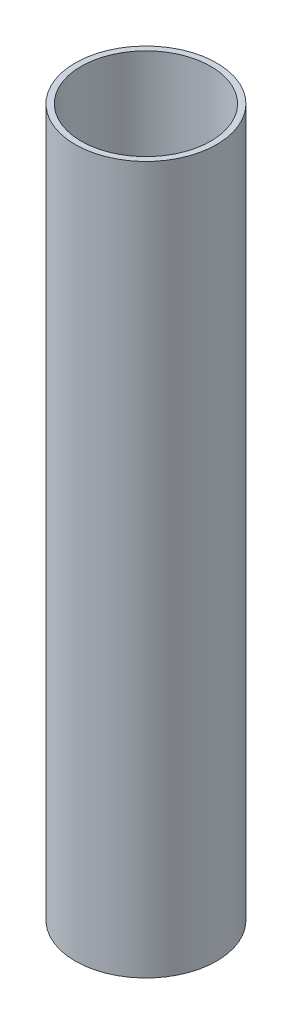
ISO-10303-21;
HEADER;
FILE_DESCRIPTION(('STEP AP214'),'2;1');
FILE_NAME('part.step','',(''),(''),'','','');
FILE_SCHEMA(('AUTOMOTIVE_DESIGN { 1 0 10303 214 1 1 1 1 }'));
ENDSEC;
DATA;
#1=APPLICATION_CONTEXT('core data for automotive mechanical design processes');
#2=APPLICATION_PROTOCOL_DEFINITION('international standard','automotive_design',2000,#1);
#3=PRODUCT_CONTEXT('',#1,'mechanical');
#4=PRODUCT('Part','Part','',(#3));
#5=PRODUCT_RELATED_PRODUCT_CATEGORY('part','',(#4));
#6=PRODUCT_DEFINITION_FORMATION('','',#4);
#7=PRODUCT_DEFINITION_CONTEXT('part definition',#1,'design');
#8=PRODUCT_DEFINITION('design','',#6,#7);
#9=PRODUCT_DEFINITION_SHAPE('','',#8);
#10=(LENGTH_UNIT() NAMED_UNIT(*) SI_UNIT(.MILLI.,.METRE.));
#11=(NAMED_UNIT(*) PLANE_ANGLE_UNIT() SI_UNIT($,.RADIAN.));
#12=(NAMED_UNIT(*) SI_UNIT($,.STERADIAN.) SOLID_ANGLE_UNIT());
#13=UNCERTAINTY_MEASURE_WITH_UNIT(LENGTH_MEASURE(1.E-05),#10,'distance_accuracy_value','');
#14=(GEOMETRIC_REPRESENTATION_CONTEXT(3) GLOBAL_UNCERTAINTY_ASSIGNED_CONTEXT((#13)) GLOBAL_UNIT_ASSIGNED_CONTEXT((#10,
#11,#12)) REPRESENTATION_CONTEXT('',''));
#15=CARTESIAN_POINT('',(0.,0.,0.));
#16=DIRECTION('',(0.,0.,1.));
#17=DIRECTION('',(1.,0.,0.));
#18=AXIS2_PLACEMENT_3D('',#15,#16,#17);
#19=CARTESIAN_POINT('',(0.,762.,0.));
#20=DIRECTION('',(0.,1.,0.));
#21=DIRECTION('',(0.,0.,1.));
#22=AXIS2_PLACEMENT_3D('',#19,#20,#21);
#23=PLANE('',#22);
#24=CARTESIAN_POINT('',(0.,762.,0.));
#25=DIRECTION('',(0.,1.,0.));
#26=DIRECTION('',(0.,0.,1.));
#27=AXIS2_PLACEMENT_3D('',#24,#25,#26);
#28=CIRCLE('',#27,76.2);
#29=CARTESIAN_POINT('',(0.,762.,76.2));
#30=VERTEX_POINT('',#29);
#31=EDGE_CURVE('E10',#30,#30,#28,.T.);
#32=ORIENTED_EDGE('',*,*,#31,.T.);
#33=EDGE_LOOP('',(#32));
#34=FACE_BOUND('',#33,.T.);
#35=CARTESIAN_POINT('',(0.,762.,0.));
#36=DIRECTION('',(0.,1.,0.));
#37=DIRECTION('',(0.,0.,1.));
#38=AXIS2_PLACEMENT_3D('',#35,#36,#37);
#39=CIRCLE('',#38,69.85);
#40=CARTESIAN_POINT('',(0.,762.,69.85));
#41=VERTEX_POINT('',#40);
#42=EDGE_CURVE('E40',#41,#41,#39,.T.);
#43=ORIENTED_EDGE('',*,*,#42,.F.);
#44=EDGE_LOOP('',(#43));
#45=FACE_BOUND('',#44,.T.);
#46=ADVANCED_FACE('F29',(#34,#45),#23,.T.);
#47=CARTESIAN_POINT('',(0.,0.,0.));
#48=DIRECTION('',(0.,1.,0.));
#49=DIRECTION('',(0.,0.,1.));
#50=AXIS2_PLACEMENT_3D('',#47,#48,#49);
#51=PLANE('',#50);
#52=CARTESIAN_POINT('',(0.,0.,0.));
#53=DIRECTION('',(0.,1.,0.));
#54=DIRECTION('',(0.,0.,1.));
#55=AXIS2_PLACEMENT_3D('',#52,#53,#54);
#56=CIRCLE('',#55,76.2);
#57=CARTESIAN_POINT('',(0.,0.,76.2));
#58=VERTEX_POINT('',#57);
#59=EDGE_CURVE('E33',#58,#58,#56,.T.);
#60=ORIENTED_EDGE('',*,*,#59,.F.);
#61=EDGE_LOOP('',(#60));
#62=FACE_BOUND('',#61,.T.);
#63=CARTESIAN_POINT('',(0.,0.,0.));
#64=DIRECTION('',(0.,1.,0.));
#65=DIRECTION('',(0.,0.,1.));
#66=AXIS2_PLACEMENT_3D('',#63,#64,#65);
#67=CIRCLE('',#66,69.85);
#68=CARTESIAN_POINT('',(0.,0.,69.85));
#69=VERTEX_POINT('',#68);
#70=EDGE_CURVE('E42',#69,#69,#67,.T.);
#71=ORIENTED_EDGE('',*,*,#70,.T.);
#72=EDGE_LOOP('',(#71));
#73=FACE_BOUND('',#72,.T.);
#74=ADVANCED_FACE('F52',(#62,#73),#51,.F.);
#75=CARTESIAN_POINT('',(0.,762.,0.));
#76=DIRECTION('',(0.,-1.,0.));
#77=DIRECTION('',(0.,0.,-1.));
#78=AXIS2_PLACEMENT_3D('',#75,#76,#77);
#79=CYLINDRICAL_SURFACE('',#78,76.2);
#80=ORIENTED_EDGE('',*,*,#31,.F.);
#81=EDGE_LOOP('',(#80));
#82=FACE_BOUND('',#81,.T.);
#83=ORIENTED_EDGE('',*,*,#59,.T.);
#84=EDGE_LOOP('',(#83));
#85=FACE_BOUND('',#84,.T.);
#86=ADVANCED_FACE('F31',(#82,#85),#79,.T.);
#87=CARTESIAN_POINT('',(0.,762.,0.));
#88=DIRECTION('',(0.,-1.,0.));
#89=DIRECTION('',(0.,0.,-1.));
#90=AXIS2_PLACEMENT_3D('',#87,#88,#89);
#91=CYLINDRICAL_SURFACE('',#90,69.85);
#92=ORIENTED_EDGE('',*,*,#42,.T.);
#93=EDGE_LOOP('',(#92));
#94=FACE_BOUND('',#93,.T.);
#95=ORIENTED_EDGE('',*,*,#70,.F.);
#96=EDGE_LOOP('',(#95));
#97=FACE_BOUND('',#96,.T.);
#98=ADVANCED_FACE('F48',(#94,#97),#91,.F.);
#99=CLOSED_SHELL('',(#46,#74,#86,#98));
#100=MANIFOLD_SOLID_BREP('B2',#99);
#101=ADVANCED_BREP_SHAPE_REPRESENTATION('',(#18,#100),#14);
#102=SHAPE_DEFINITION_REPRESENTATION(#9,#101);
ENDSEC;
END-ISO-10303-21;
